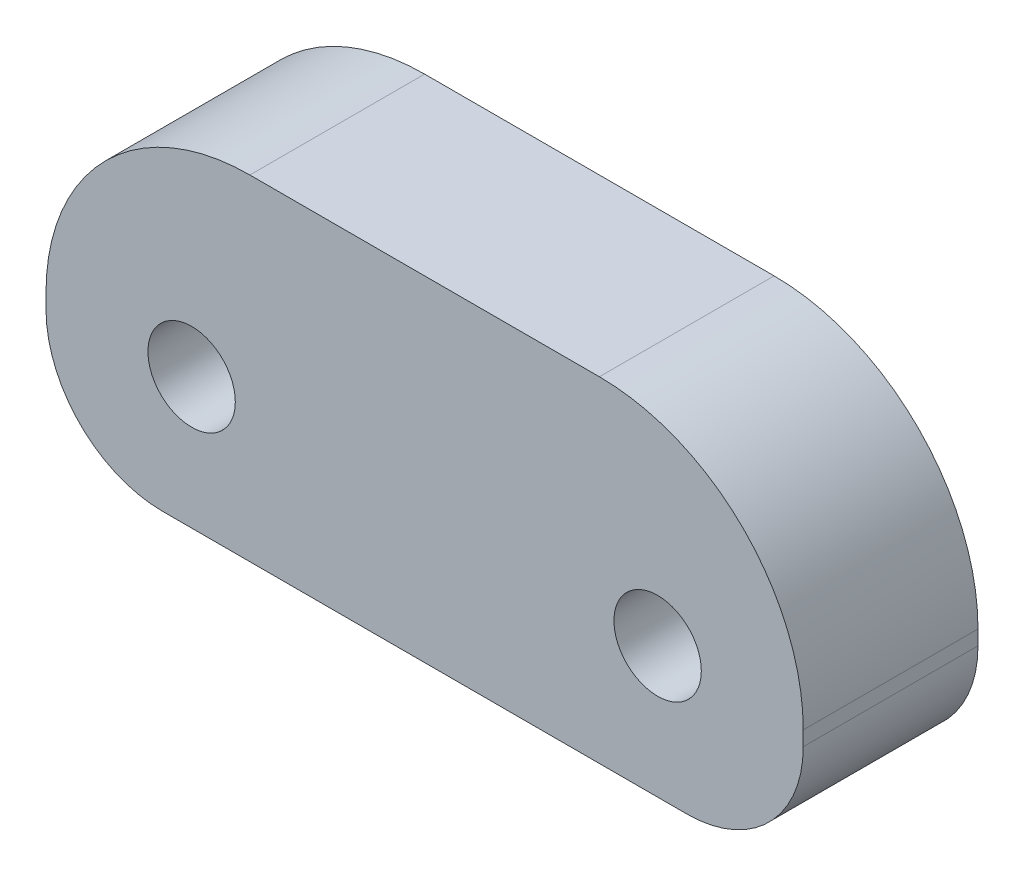
ISO-10303-21;
HEADER;
FILE_DESCRIPTION(('STEP AP214'),'2;1');
FILE_NAME('part.step','',(''),(''),'','','');
FILE_SCHEMA(('AUTOMOTIVE_DESIGN { 1 0 10303 214 1 1 1 1 }'));
ENDSEC;
DATA;
#1=APPLICATION_CONTEXT('core data for automotive mechanical design processes');
#2=APPLICATION_PROTOCOL_DEFINITION('international standard','automotive_design',2000,#1);
#3=PRODUCT_CONTEXT('',#1,'mechanical');
#4=PRODUCT('Part','Part','',(#3));
#5=PRODUCT_RELATED_PRODUCT_CATEGORY('part','',(#4));
#6=PRODUCT_DEFINITION_FORMATION('','',#4);
#7=PRODUCT_DEFINITION_CONTEXT('part definition',#1,'design');
#8=PRODUCT_DEFINITION('design','',#6,#7);
#9=PRODUCT_DEFINITION_SHAPE('','',#8);
#10=(LENGTH_UNIT() NAMED_UNIT(*) SI_UNIT(.MILLI.,.METRE.));
#11=(NAMED_UNIT(*) PLANE_ANGLE_UNIT() SI_UNIT($,.RADIAN.));
#12=(NAMED_UNIT(*) SI_UNIT($,.STERADIAN.) SOLID_ANGLE_UNIT());
#13=UNCERTAINTY_MEASURE_WITH_UNIT(LENGTH_MEASURE(1.E-05),#10,'distance_accuracy_value','');
#14=(GEOMETRIC_REPRESENTATION_CONTEXT(3) GLOBAL_UNCERTAINTY_ASSIGNED_CONTEXT((#13)) GLOBAL_UNIT_ASSIGNED_CONTEXT((#10,
#11,#12)) REPRESENTATION_CONTEXT('',''));
#15=CARTESIAN_POINT('',(0.,0.,0.));
#16=DIRECTION('',(0.,0.,1.));
#17=DIRECTION('',(1.,0.,0.));
#18=AXIS2_PLACEMENT_3D('',#15,#16,#17);
#19=CARTESIAN_POINT('',(0.,-5.75,6.));
#20=DIRECTION('',(0.,1.,0.));
#21=DIRECTION('',(-1.,0.,0.));
#22=AXIS2_PLACEMENT_3D('',#19,#20,#21);
#23=PLANE('',#22);
#24=DIRECTION('',(1.,0.,0.));
#25=VECTOR('',#24,1.);
#26=CARTESIAN_POINT('',(0.,-5.75,0.));
#27=LINE('',#26,#25);
#28=CARTESIAN_POINT('',(-9.,-5.75,0.));
#29=VERTEX_POINT('',#28);
#30=CARTESIAN_POINT('',(9.,-5.75,0.));
#31=VERTEX_POINT('',#30);
#32=EDGE_CURVE('E177',#29,#31,#27,.T.);
#33=ORIENTED_EDGE('',*,*,#32,.T.);
#34=DIRECTION('',(0.,0.,-1.));
#35=VECTOR('',#34,1.);
#36=CARTESIAN_POINT('',(9.,-5.75,6.));
#37=LINE('',#36,#35);
#38=CARTESIAN_POINT('',(9.,-5.75,6.));
#39=VERTEX_POINT('',#38);
#40=EDGE_CURVE('E56',#31,#39,#37,.F.);
#41=ORIENTED_EDGE('',*,*,#40,.T.);
#42=DIRECTION('',(1.,0.,0.));
#43=VECTOR('',#42,1.);
#44=CARTESIAN_POINT('',(0.,-5.75,6.));
#45=LINE('',#44,#43);
#46=CARTESIAN_POINT('',(-9.,-5.75,6.));
#47=VERTEX_POINT('',#46);
#48=EDGE_CURVE('E166',#47,#39,#45,.T.);
#49=ORIENTED_EDGE('',*,*,#48,.F.);
#50=DIRECTION('',(0.,0.,-1.));
#51=VECTOR('',#50,1.);
#52=CARTESIAN_POINT('',(-9.,-5.75,0.));
#53=LINE('',#52,#51);
#54=EDGE_CURVE('E155',#47,#29,#53,.T.);
#55=ORIENTED_EDGE('',*,*,#54,.T.);
#56=EDGE_LOOP('',(#33,#41,#49,#55));
#57=FACE_BOUND('',#56,.T.);
#58=ADVANCED_FACE('F35',(#57),#23,.F.);
#59=CARTESIAN_POINT('',(13.,0.,6.));
#60=DIRECTION('',(-1.,0.,0.));
#61=DIRECTION('',(0.,0.,1.));
#62=AXIS2_PLACEMENT_3D('',#59,#60,#61);
#63=PLANE('',#62);
#64=DIRECTION('',(0.,1.,0.));
#65=VECTOR('',#64,1.);
#66=CARTESIAN_POINT('',(13.,0.,6.));
#67=LINE('',#66,#65);
#68=CARTESIAN_POINT('',(13.,-1.75,6.));
#69=VERTEX_POINT('',#68);
#70=CARTESIAN_POINT('',(13.,-1.25,6.));
#71=VERTEX_POINT('',#70);
#72=EDGE_CURVE('E165',#69,#71,#67,.T.);
#73=ORIENTED_EDGE('',*,*,#72,.F.);
#74=DIRECTION('',(0.,0.,-1.));
#75=VECTOR('',#74,1.);
#76=CARTESIAN_POINT('',(13.,-1.75,6.));
#77=LINE('',#76,#75);
#78=CARTESIAN_POINT('',(13.,-1.75,0.));
#79=VERTEX_POINT('',#78);
#80=EDGE_CURVE('E148',#69,#79,#77,.T.);
#81=ORIENTED_EDGE('',*,*,#80,.T.);
#82=DIRECTION('',(0.,1.,0.));
#83=VECTOR('',#82,1.);
#84=CARTESIAN_POINT('',(13.,0.,0.));
#85=LINE('',#84,#83);
#86=CARTESIAN_POINT('',(13.,-1.25,0.));
#87=VERTEX_POINT('',#86);
#88=EDGE_CURVE('E123',#79,#87,#85,.T.);
#89=ORIENTED_EDGE('',*,*,#88,.T.);
#90=DIRECTION('',(0.,0.,-1.));
#91=VECTOR('',#90,1.);
#92=CARTESIAN_POINT('',(13.,-1.25,6.));
#93=LINE('',#92,#91);
#94=EDGE_CURVE('E140',#87,#71,#93,.F.);
#95=ORIENTED_EDGE('',*,*,#94,.T.);
#96=EDGE_LOOP('',(#73,#81,#89,#95));
#97=FACE_BOUND('',#96,.T.);
#98=ADVANCED_FACE('F170',(#97),#63,.F.);
#99=CARTESIAN_POINT('',(0.,5.75,6.));
#100=DIRECTION('',(0.,1.,0.));
#101=DIRECTION('',(-1.,0.,0.));
#102=AXIS2_PLACEMENT_3D('',#99,#100,#101);
#103=PLANE('',#102);
#104=DIRECTION('',(1.,0.,0.));
#105=VECTOR('',#104,1.);
#106=CARTESIAN_POINT('',(0.,5.75,6.));
#107=LINE('',#106,#105);
#108=CARTESIAN_POINT('',(-6.,5.75,6.));
#109=VERTEX_POINT('',#108);
#110=CARTESIAN_POINT('',(5.99999999999999,5.75,6.));
#111=VERTEX_POINT('',#110);
#112=EDGE_CURVE('E173',#109,#111,#107,.T.);
#113=ORIENTED_EDGE('',*,*,#112,.T.);
#114=DIRECTION('',(0.,0.,-1.));
#115=VECTOR('',#114,1.);
#116=CARTESIAN_POINT('',(5.99999999999999,5.75,0.));
#117=LINE('',#116,#115);
#118=CARTESIAN_POINT('',(5.99999999999999,5.75,0.));
#119=VERTEX_POINT('',#118);
#120=EDGE_CURVE('E114',#111,#119,#117,.T.);
#121=ORIENTED_EDGE('',*,*,#120,.T.);
#122=DIRECTION('',(1.,0.,0.));
#123=VECTOR('',#122,1.);
#124=CARTESIAN_POINT('',(0.,5.75,0.));
#125=LINE('',#124,#123);
#126=CARTESIAN_POINT('',(-6.,5.75,0.));
#127=VERTEX_POINT('',#126);
#128=EDGE_CURVE('E107',#127,#119,#125,.T.);
#129=ORIENTED_EDGE('',*,*,#128,.F.);
#130=DIRECTION('',(0.,0.,-1.));
#131=VECTOR('',#130,1.);
#132=CARTESIAN_POINT('',(-6.,5.75,6.));
#133=LINE('',#132,#131);
#134=EDGE_CURVE('E120',#127,#109,#133,.F.);
#135=ORIENTED_EDGE('',*,*,#134,.T.);
#136=EDGE_LOOP('',(#113,#121,#129,#135));
#137=FACE_BOUND('',#136,.T.);
#138=ADVANCED_FACE('F119',(#137),#103,.T.);
#139=CARTESIAN_POINT('',(-8.,-1.25,6.));
#140=DIRECTION('',(0.,0.,-1.));
#141=DIRECTION('',(-1.,0.,0.));
#142=AXIS2_PLACEMENT_3D('',#139,#140,#141);
#143=CYLINDRICAL_SURFACE('',#142,1.5);
#144=CARTESIAN_POINT('',(-8.,-1.25,6.));
#145=DIRECTION('',(0.,0.,1.));
#146=DIRECTION('',(1.,0.,0.));
#147=AXIS2_PLACEMENT_3D('',#144,#145,#146);
#148=CIRCLE('',#147,1.5);
#149=CARTESIAN_POINT('',(-6.5,-1.25,6.));
#150=VERTEX_POINT('',#149);
#151=EDGE_CURVE('E133',#150,#150,#148,.T.);
#152=ORIENTED_EDGE('',*,*,#151,.T.);
#153=EDGE_LOOP('',(#152));
#154=FACE_BOUND('',#153,.T.);
#155=CARTESIAN_POINT('',(-8.,-1.25,0.));
#156=DIRECTION('',(0.,0.,1.));
#157=DIRECTION('',(1.,0.,0.));
#158=AXIS2_PLACEMENT_3D('',#155,#156,#157);
#159=CIRCLE('',#158,1.5);
#160=CARTESIAN_POINT('',(-6.5,-1.25,0.));
#161=VERTEX_POINT('',#160);
#162=EDGE_CURVE('E183',#161,#161,#159,.T.);
#163=ORIENTED_EDGE('',*,*,#162,.F.);
#164=EDGE_LOOP('',(#163));
#165=FACE_BOUND('',#164,.T.);
#166=ADVANCED_FACE('F196',(#154,#165),#143,.F.);
#167=CARTESIAN_POINT('',(-13.,0.,6.));
#168=DIRECTION('',(-1.,0.,0.));
#169=DIRECTION('',(0.,0.,1.));
#170=AXIS2_PLACEMENT_3D('',#167,#168,#169);
#171=PLANE('',#170);
#172=DIRECTION('',(0.,1.,0.));
#173=VECTOR('',#172,1.);
#174=CARTESIAN_POINT('',(-13.,0.,0.));
#175=LINE('',#174,#173);
#176=CARTESIAN_POINT('',(-13.,-1.75,0.));
#177=VERTEX_POINT('',#176);
#178=CARTESIAN_POINT('',(-13.,-1.25,0.));
#179=VERTEX_POINT('',#178);
#180=EDGE_CURVE('E108',#177,#179,#175,.T.);
#181=ORIENTED_EDGE('',*,*,#180,.F.);
#182=DIRECTION('',(0.,0.,-1.));
#183=VECTOR('',#182,1.);
#184=CARTESIAN_POINT('',(-13.,-1.75,6.));
#185=LINE('',#184,#183);
#186=CARTESIAN_POINT('',(-13.,-1.75,6.));
#187=VERTEX_POINT('',#186);
#188=EDGE_CURVE('E11',#177,#187,#185,.F.);
#189=ORIENTED_EDGE('',*,*,#188,.T.);
#190=DIRECTION('',(0.,1.,0.));
#191=VECTOR('',#190,1.);
#192=CARTESIAN_POINT('',(-13.,0.,6.));
#193=LINE('',#192,#191);
#194=CARTESIAN_POINT('',(-13.,-1.25,6.));
#195=VERTEX_POINT('',#194);
#196=EDGE_CURVE('E192',#187,#195,#193,.T.);
#197=ORIENTED_EDGE('',*,*,#196,.T.);
#198=DIRECTION('',(0.,0.,-1.));
#199=VECTOR('',#198,1.);
#200=CARTESIAN_POINT('',(-13.,-1.25,6.));
#201=LINE('',#200,#199);
#202=EDGE_CURVE('E146',#195,#179,#201,.T.);
#203=ORIENTED_EDGE('',*,*,#202,.T.);
#204=EDGE_LOOP('',(#181,#189,#197,#203));
#205=FACE_BOUND('',#204,.T.);
#206=ADVANCED_FACE('F205',(#205),#171,.T.);
#207=CARTESIAN_POINT('',(8.,-1.25,6.));
#208=DIRECTION('',(0.,0.,-1.));
#209=DIRECTION('',(-1.,0.,0.));
#210=AXIS2_PLACEMENT_3D('',#207,#208,#209);
#211=CYLINDRICAL_SURFACE('',#210,1.5);
#212=CARTESIAN_POINT('',(8.,-1.25,6.));
#213=DIRECTION('',(0.,0.,1.));
#214=DIRECTION('',(1.,0.,0.));
#215=AXIS2_PLACEMENT_3D('',#212,#213,#214);
#216=CIRCLE('',#215,1.5);
#217=CARTESIAN_POINT('',(9.50000000000001,-1.25,6.));
#218=VERTEX_POINT('',#217);
#219=EDGE_CURVE('E129',#218,#218,#216,.F.);
#220=ORIENTED_EDGE('',*,*,#219,.F.);
#221=EDGE_LOOP('',(#220));
#222=FACE_BOUND('',#221,.T.);
#223=CARTESIAN_POINT('',(8.,-1.25,0.));
#224=DIRECTION('',(0.,0.,1.));
#225=DIRECTION('',(1.,0.,0.));
#226=AXIS2_PLACEMENT_3D('',#223,#224,#225);
#227=CIRCLE('',#226,1.5);
#228=CARTESIAN_POINT('',(9.50000000000001,-1.25,0.));
#229=VERTEX_POINT('',#228);
#230=EDGE_CURVE('E136',#229,#229,#227,.F.);
#231=ORIENTED_EDGE('',*,*,#230,.T.);
#232=EDGE_LOOP('',(#231));
#233=FACE_BOUND('',#232,.T.);
#234=ADVANCED_FACE('F200',(#222,#233),#211,.F.);
#235=CARTESIAN_POINT('',(0.,0.,6.));
#236=DIRECTION('',(0.,0.,1.));
#237=DIRECTION('',(1.,0.,0.));
#238=AXIS2_PLACEMENT_3D('',#235,#236,#237);
#239=PLANE('',#238);
#240=ORIENTED_EDGE('',*,*,#48,.T.);
#241=CARTESIAN_POINT('',(9.,-1.75,6.));
#242=DIRECTION('',(0.,0.,1.));
#243=DIRECTION('',(1.,0.,0.));
#244=AXIS2_PLACEMENT_3D('',#241,#242,#243);
#245=CIRCLE('',#244,4.);
#246=EDGE_CURVE('E43',#39,#69,#245,.T.);
#247=ORIENTED_EDGE('',*,*,#246,.T.);
#248=ORIENTED_EDGE('',*,*,#72,.T.);
#249=CARTESIAN_POINT('',(6.,-1.25,6.));
#250=DIRECTION('',(0.,0.,1.));
#251=DIRECTION('',(1.,0.,0.));
#252=AXIS2_PLACEMENT_3D('',#249,#250,#251);
#253=CIRCLE('',#252,7.);
#254=EDGE_CURVE('E144',#71,#111,#253,.T.);
#255=ORIENTED_EDGE('',*,*,#254,.T.);
#256=ORIENTED_EDGE('',*,*,#112,.F.);
#257=CARTESIAN_POINT('',(-6.,-1.25,6.));
#258=DIRECTION('',(0.,0.,1.));
#259=DIRECTION('',(1.,0.,0.));
#260=AXIS2_PLACEMENT_3D('',#257,#258,#259);
#261=CIRCLE('',#260,7.);
#262=EDGE_CURVE('E128',#109,#195,#261,.T.);
#263=ORIENTED_EDGE('',*,*,#262,.T.);
#264=ORIENTED_EDGE('',*,*,#196,.F.);
#265=CARTESIAN_POINT('',(-9.,-1.75,6.));
#266=DIRECTION('',(0.,0.,1.));
#267=DIRECTION('',(1.,0.,0.));
#268=AXIS2_PLACEMENT_3D('',#265,#266,#267);
#269=CIRCLE('',#268,4.);
#270=EDGE_CURVE('E159',#187,#47,#269,.T.);
#271=ORIENTED_EDGE('',*,*,#270,.T.);
#272=EDGE_LOOP('',(#240,#247,#248,#255,#256,#263,#264,#271));
#273=FACE_BOUND('',#272,.T.);
#274=ORIENTED_EDGE('',*,*,#151,.F.);
#275=EDGE_LOOP('',(#274));
#276=FACE_BOUND('',#275,.T.);
#277=ORIENTED_EDGE('',*,*,#219,.T.);
#278=EDGE_LOOP('',(#277));
#279=FACE_BOUND('',#278,.T.);
#280=ADVANCED_FACE('F163',(#273,#276,#279),#239,.T.);
#281=CARTESIAN_POINT('',(0.,0.,0.));
#282=DIRECTION('',(0.,0.,1.));
#283=DIRECTION('',(1.,0.,0.));
#284=AXIS2_PLACEMENT_3D('',#281,#282,#283);
#285=PLANE('',#284);
#286=ORIENTED_EDGE('',*,*,#88,.F.);
#287=CARTESIAN_POINT('',(9.,-1.75,0.));
#288=DIRECTION('',(0.,0.,1.));
#289=DIRECTION('',(1.,0.,0.));
#290=AXIS2_PLACEMENT_3D('',#287,#288,#289);
#291=CIRCLE('',#290,4.);
#292=EDGE_CURVE('E153',#79,#31,#291,.F.);
#293=ORIENTED_EDGE('',*,*,#292,.T.);
#294=ORIENTED_EDGE('',*,*,#32,.F.);
#295=CARTESIAN_POINT('',(-9.,-1.75,0.));
#296=DIRECTION('',(0.,0.,1.));
#297=DIRECTION('',(1.,0.,0.));
#298=AXIS2_PLACEMENT_3D('',#295,#296,#297);
#299=CIRCLE('',#298,4.);
#300=EDGE_CURVE('E151',#29,#177,#299,.F.);
#301=ORIENTED_EDGE('',*,*,#300,.T.);
#302=ORIENTED_EDGE('',*,*,#180,.T.);
#303=CARTESIAN_POINT('',(-6.,-1.25,0.));
#304=DIRECTION('',(0.,0.,1.));
#305=DIRECTION('',(1.,0.,0.));
#306=AXIS2_PLACEMENT_3D('',#303,#304,#305);
#307=CIRCLE('',#306,7.);
#308=EDGE_CURVE('E101',#179,#127,#307,.F.);
#309=ORIENTED_EDGE('',*,*,#308,.T.);
#310=ORIENTED_EDGE('',*,*,#128,.T.);
#311=CARTESIAN_POINT('',(6.,-1.25,0.));
#312=DIRECTION('',(0.,0.,1.));
#313=DIRECTION('',(1.,0.,0.));
#314=AXIS2_PLACEMENT_3D('',#311,#312,#313);
#315=CIRCLE('',#314,7.);
#316=EDGE_CURVE('E113',#119,#87,#315,.F.);
#317=ORIENTED_EDGE('',*,*,#316,.T.);
#318=EDGE_LOOP('',(#286,#293,#294,#301,#302,#309,#310,#317));
#319=FACE_BOUND('',#318,.T.);
#320=ORIENTED_EDGE('',*,*,#162,.T.);
#321=EDGE_LOOP('',(#320));
#322=FACE_BOUND('',#321,.T.);
#323=ORIENTED_EDGE('',*,*,#230,.F.);
#324=EDGE_LOOP('',(#323));
#325=FACE_BOUND('',#324,.T.);
#326=ADVANCED_FACE('F104',(#319,#322,#325),#285,.F.);
#327=CARTESIAN_POINT('',(6.,-1.25,6.));
#328=DIRECTION('',(0.,0.,1.));
#329=DIRECTION('',(1.,0.,0.));
#330=AXIS2_PLACEMENT_3D('',#327,#328,#329);
#331=CYLINDRICAL_SURFACE('',#330,7.);
#332=ORIENTED_EDGE('',*,*,#254,.F.);
#333=ORIENTED_EDGE('',*,*,#94,.F.);
#334=ORIENTED_EDGE('',*,*,#316,.F.);
#335=ORIENTED_EDGE('',*,*,#120,.F.);
#336=EDGE_LOOP('',(#332,#333,#334,#335));
#337=FACE_BOUND('',#336,.T.);
#338=ADVANCED_FACE('F221',(#337),#331,.T.);
#339=CARTESIAN_POINT('',(-6.,-1.25,6.));
#340=DIRECTION('',(0.,0.,-1.));
#341=DIRECTION('',(-1.,0.,0.));
#342=AXIS2_PLACEMENT_3D('',#339,#340,#341);
#343=CYLINDRICAL_SURFACE('',#342,7.);
#344=ORIENTED_EDGE('',*,*,#262,.F.);
#345=ORIENTED_EDGE('',*,*,#134,.F.);
#346=ORIENTED_EDGE('',*,*,#308,.F.);
#347=ORIENTED_EDGE('',*,*,#202,.F.);
#348=EDGE_LOOP('',(#344,#345,#346,#347));
#349=FACE_BOUND('',#348,.T.);
#350=ADVANCED_FACE('F126',(#349),#343,.T.);
#351=CARTESIAN_POINT('',(9.,-1.75,6.));
#352=DIRECTION('',(0.,0.,-1.));
#353=DIRECTION('',(-1.,0.,0.));
#354=AXIS2_PLACEMENT_3D('',#351,#352,#353);
#355=CYLINDRICAL_SURFACE('',#354,4.);
#356=ORIENTED_EDGE('',*,*,#246,.F.);
#357=ORIENTED_EDGE('',*,*,#40,.F.);
#358=ORIENTED_EDGE('',*,*,#292,.F.);
#359=ORIENTED_EDGE('',*,*,#80,.F.);
#360=EDGE_LOOP('',(#356,#357,#358,#359));
#361=FACE_BOUND('',#360,.T.);
#362=ADVANCED_FACE('F175',(#361),#355,.T.);
#363=CARTESIAN_POINT('',(-9.,-1.75,6.));
#364=DIRECTION('',(0.,0.,1.));
#365=DIRECTION('',(1.,0.,0.));
#366=AXIS2_PLACEMENT_3D('',#363,#364,#365);
#367=CYLINDRICAL_SURFACE('',#366,4.);
#368=ORIENTED_EDGE('',*,*,#270,.F.);
#369=ORIENTED_EDGE('',*,*,#188,.F.);
#370=ORIENTED_EDGE('',*,*,#300,.F.);
#371=ORIENTED_EDGE('',*,*,#54,.F.);
#372=EDGE_LOOP('',(#368,#369,#370,#371));
#373=FACE_BOUND('',#372,.T.);
#374=ADVANCED_FACE('F37',(#373),#367,.T.);
#375=CLOSED_SHELL('',(#58,#98,#138,#166,#206,#234,#280,#326,#338,#350,#362,#374));
#376=MANIFOLD_SOLID_BREP('B2',#375);
#377=ADVANCED_BREP_SHAPE_REPRESENTATION('',(#18,#376),#14);
#378=SHAPE_DEFINITION_REPRESENTATION(#9,#377);
ENDSEC;
END-ISO-10303-21;
